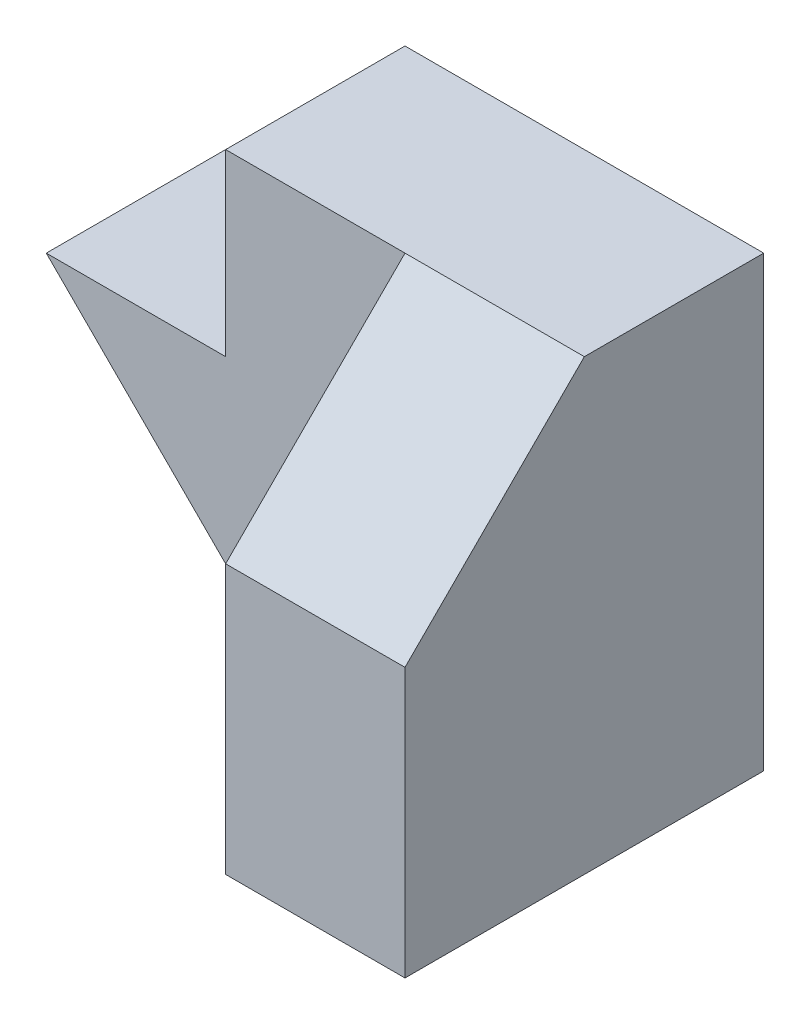
ISO-10303-21;
HEADER;
FILE_DESCRIPTION(('STEP AP214'),'2;1');
FILE_NAME('part.step','',(''),(''),'','','');
FILE_SCHEMA(('AUTOMOTIVE_DESIGN { 1 0 10303 214 1 1 1 1 }'));
ENDSEC;
DATA;
#1=APPLICATION_CONTEXT('core data for automotive mechanical design processes');
#2=APPLICATION_PROTOCOL_DEFINITION('international standard','automotive_design',2000,#1);
#3=PRODUCT_CONTEXT('',#1,'mechanical');
#4=PRODUCT('Part','Part','',(#3));
#5=PRODUCT_RELATED_PRODUCT_CATEGORY('part','',(#4));
#6=PRODUCT_DEFINITION_FORMATION('','',#4);
#7=PRODUCT_DEFINITION_CONTEXT('part definition',#1,'design');
#8=PRODUCT_DEFINITION('design','',#6,#7);
#9=PRODUCT_DEFINITION_SHAPE('','',#8);
#10=(LENGTH_UNIT() NAMED_UNIT(*) SI_UNIT(.MILLI.,.METRE.));
#11=(NAMED_UNIT(*) PLANE_ANGLE_UNIT() SI_UNIT($,.RADIAN.));
#12=(NAMED_UNIT(*) SI_UNIT($,.STERADIAN.) SOLID_ANGLE_UNIT());
#13=UNCERTAINTY_MEASURE_WITH_UNIT(LENGTH_MEASURE(1.E-05),#10,'distance_accuracy_value','');
#14=(GEOMETRIC_REPRESENTATION_CONTEXT(3) GLOBAL_UNCERTAINTY_ASSIGNED_CONTEXT((#13)) GLOBAL_UNIT_ASSIGNED_CONTEXT((#10,
#11,#12)) REPRESENTATION_CONTEXT('',''));
#15=CARTESIAN_POINT('',(0.,0.,0.));
#16=DIRECTION('',(0.,0.,1.));
#17=DIRECTION('',(1.,0.,0.));
#18=AXIS2_PLACEMENT_3D('',#15,#16,#17);
#19=CARTESIAN_POINT('',(15.,0.,20.));
#20=DIRECTION('',(-1.,0.,0.));
#21=DIRECTION('',(0.,0.,1.));
#22=AXIS2_PLACEMENT_3D('',#19,#20,#21);
#23=PLANE('',#22);
#24=DIRECTION('',(0.,0.707106781186547,-0.707106781186548));
#25=VECTOR('',#24,1.);
#26=CARTESIAN_POINT('',(15.,15.,20.));
#27=LINE('',#26,#25);
#28=CARTESIAN_POINT('',(15.,15.,20.));
#29=VERTEX_POINT('',#28);
#30=CARTESIAN_POINT('',(15.,25.,10.));
#31=VERTEX_POINT('',#30);
#32=EDGE_CURVE('E156',#29,#31,#27,.T.);
#33=ORIENTED_EDGE('',*,*,#32,.F.);
#34=DIRECTION('',(0.,1.,0.));
#35=VECTOR('',#34,1.);
#36=CARTESIAN_POINT('',(15.,0.,20.));
#37=LINE('',#36,#35);
#38=CARTESIAN_POINT('',(15.,0.,20.));
#39=VERTEX_POINT('',#38);
#40=EDGE_CURVE('E109',#39,#29,#37,.T.);
#41=ORIENTED_EDGE('',*,*,#40,.F.);
#42=DIRECTION('',(0.,0.,-1.));
#43=VECTOR('',#42,1.);
#44=CARTESIAN_POINT('',(15.,0.,20.));
#45=LINE('',#44,#43);
#46=CARTESIAN_POINT('',(15.,0.,0.));
#47=VERTEX_POINT('',#46);
#48=EDGE_CURVE('E41',#39,#47,#45,.T.);
#49=ORIENTED_EDGE('',*,*,#48,.T.);
#50=DIRECTION('',(0.,1.,0.));
#51=VECTOR('',#50,1.);
#52=CARTESIAN_POINT('',(15.,0.,0.));
#53=LINE('',#52,#51);
#54=CARTESIAN_POINT('',(15.,25.,0.));
#55=VERTEX_POINT('',#54);
#56=EDGE_CURVE('E123',#47,#55,#53,.T.);
#57=ORIENTED_EDGE('',*,*,#56,.T.);
#58=DIRECTION('',(0.,0.,-1.));
#59=VECTOR('',#58,1.);
#60=CARTESIAN_POINT('',(15.,25.,20.));
#61=LINE('',#60,#59);
#62=EDGE_CURVE('E115',#31,#55,#61,.T.);
#63=ORIENTED_EDGE('',*,*,#62,.F.);
#64=EDGE_LOOP('',(#33,#41,#49,#57,#63));
#65=FACE_BOUND('',#64,.T.);
#66=ADVANCED_FACE('F33',(#65),#23,.F.);
#67=CARTESIAN_POINT('',(15.,25.,20.));
#68=DIRECTION('',(0.,-1.,0.));
#69=DIRECTION('',(1.,0.,0.));
#70=AXIS2_PLACEMENT_3D('',#67,#68,#69);
#71=PLANE('',#70);
#72=DIRECTION('',(-1.,0.,0.));
#73=VECTOR('',#72,1.);
#74=CARTESIAN_POINT('',(15.,25.,10.));
#75=LINE('',#74,#73);
#76=CARTESIAN_POINT('',(5.,25.,10.));
#77=VERTEX_POINT('',#76);
#78=EDGE_CURVE('E153',#31,#77,#75,.T.);
#79=ORIENTED_EDGE('',*,*,#78,.F.);
#80=ORIENTED_EDGE('',*,*,#62,.T.);
#81=DIRECTION('',(-1.,0.,0.));
#82=VECTOR('',#81,1.);
#83=CARTESIAN_POINT('',(15.,25.,0.));
#84=LINE('',#83,#82);
#85=CARTESIAN_POINT('',(-5.,25.,0.));
#86=VERTEX_POINT('',#85);
#87=EDGE_CURVE('E102',#55,#86,#84,.T.);
#88=ORIENTED_EDGE('',*,*,#87,.T.);
#89=DIRECTION('',(0.,0.,-1.));
#90=VECTOR('',#89,1.);
#91=CARTESIAN_POINT('',(-5.,25.,20.));
#92=LINE('',#91,#90);
#93=CARTESIAN_POINT('',(-5.,25.,10.));
#94=VERTEX_POINT('',#93);
#95=EDGE_CURVE('E92',#94,#86,#92,.T.);
#96=ORIENTED_EDGE('',*,*,#95,.F.);
#97=DIRECTION('',(-1.,0.,0.));
#98=VECTOR('',#97,1.);
#99=CARTESIAN_POINT('',(-5.,25.,10.));
#100=LINE('',#99,#98);
#101=EDGE_CURVE('E135',#77,#94,#100,.T.);
#102=ORIENTED_EDGE('',*,*,#101,.F.);
#103=EDGE_LOOP('',(#79,#80,#88,#96,#102));
#104=FACE_BOUND('',#103,.T.);
#105=ADVANCED_FACE('F172',(#104),#71,.F.);
#106=CARTESIAN_POINT('',(0.,0.,20.));
#107=DIRECTION('',(0.,0.,1.));
#108=DIRECTION('',(1.,0.,0.));
#109=AXIS2_PLACEMENT_3D('',#106,#107,#108);
#110=PLANE('',#109);
#111=ORIENTED_EDGE('',*,*,#40,.T.);
#112=DIRECTION('',(-1.,0.,0.));
#113=VECTOR('',#112,1.);
#114=CARTESIAN_POINT('',(15.,15.,20.));
#115=LINE('',#114,#113);
#116=CARTESIAN_POINT('',(5.,15.,20.));
#117=VERTEX_POINT('',#116);
#118=EDGE_CURVE('E136',#29,#117,#115,.T.);
#119=ORIENTED_EDGE('',*,*,#118,.T.);
#120=DIRECTION('',(0.,1.,0.));
#121=VECTOR('',#120,1.);
#122=CARTESIAN_POINT('',(5.,25.,20.));
#123=LINE('',#122,#121);
#124=CARTESIAN_POINT('',(5.,0.,20.));
#125=VERTEX_POINT('',#124);
#126=EDGE_CURVE('E133',#125,#117,#123,.T.);
#127=ORIENTED_EDGE('',*,*,#126,.F.);
#128=DIRECTION('',(1.,0.,0.));
#129=VECTOR('',#128,1.);
#130=CARTESIAN_POINT('',(0.,0.,20.));
#131=LINE('',#130,#129);
#132=EDGE_CURVE('E56',#125,#39,#131,.T.);
#133=ORIENTED_EDGE('',*,*,#132,.T.);
#134=EDGE_LOOP('',(#111,#119,#127,#133));
#135=FACE_BOUND('',#134,.T.);
#136=ADVANCED_FACE('F201',(#135),#110,.T.);
#137=CARTESIAN_POINT('',(5.,25.,10.));
#138=DIRECTION('',(1.,0.,0.));
#139=DIRECTION('',(0.,1.,0.));
#140=AXIS2_PLACEMENT_3D('',#137,#138,#139);
#141=PLANE('',#140);
#142=DIRECTION('',(0.,0.707106781186547,-0.707106781186548));
#143=VECTOR('',#142,1.);
#144=CARTESIAN_POINT('',(5.,15.,20.));
#145=LINE('',#144,#143);
#146=EDGE_CURVE('E157',#117,#77,#145,.T.);
#147=ORIENTED_EDGE('',*,*,#146,.T.);
#148=DIRECTION('',(0.,1.,0.));
#149=VECTOR('',#148,1.);
#150=CARTESIAN_POINT('',(5.,25.,10.));
#151=LINE('',#150,#149);
#152=CARTESIAN_POINT('',(5.,0.,10.));
#153=VERTEX_POINT('',#152);
#154=EDGE_CURVE('E132',#153,#77,#151,.T.);
#155=ORIENTED_EDGE('',*,*,#154,.F.);
#156=DIRECTION('',(0.,0.,1.));
#157=VECTOR('',#156,1.);
#158=CARTESIAN_POINT('',(5.,0.,10.));
#159=LINE('',#158,#157);
#160=EDGE_CURVE('E48',#153,#125,#159,.T.);
#161=ORIENTED_EDGE('',*,*,#160,.T.);
#162=ORIENTED_EDGE('',*,*,#126,.T.);
#163=EDGE_LOOP('',(#147,#155,#161,#162));
#164=FACE_BOUND('',#163,.T.);
#165=ADVANCED_FACE('F187',(#164),#141,.F.);
#166=CARTESIAN_POINT('',(-15.,15.,20.));
#167=DIRECTION('',(0.707106781186547,0.707106781186548,0.));
#168=DIRECTION('',(-0.707106781186548,0.707106781186547,0.));
#169=AXIS2_PLACEMENT_3D('',#166,#167,#168);
#170=PLANE('',#169);
#171=DIRECTION('',(0.,0.,-1.));
#172=VECTOR('',#171,1.);
#173=CARTESIAN_POINT('',(0.,0.,20.));
#174=LINE('',#173,#172);
#175=CARTESIAN_POINT('',(0.,0.,10.));
#176=VERTEX_POINT('',#175);
#177=CARTESIAN_POINT('',(0.,0.,0.));
#178=VERTEX_POINT('',#177);
#179=EDGE_CURVE('E11',#176,#178,#174,.T.);
#180=ORIENTED_EDGE('',*,*,#179,.F.);
#181=DIRECTION('',(0.707106781186548,-0.707106781186547,0.));
#182=VECTOR('',#181,1.);
#183=CARTESIAN_POINT('',(0.,0.,10.));
#184=LINE('',#183,#182);
#185=CARTESIAN_POINT('',(-15.,15.,10.));
#186=VERTEX_POINT('',#185);
#187=EDGE_CURVE('E142',#186,#176,#184,.T.);
#188=ORIENTED_EDGE('',*,*,#187,.F.);
#189=DIRECTION('',(0.,0.,-1.));
#190=VECTOR('',#189,1.);
#191=CARTESIAN_POINT('',(-15.,15.,20.));
#192=LINE('',#191,#190);
#193=CARTESIAN_POINT('',(-15.,15.,0.));
#194=VERTEX_POINT('',#193);
#195=EDGE_CURVE('E93',#186,#194,#192,.T.);
#196=ORIENTED_EDGE('',*,*,#195,.T.);
#197=DIRECTION('',(0.707106781186548,-0.707106781186547,0.));
#198=VECTOR('',#197,1.);
#199=CARTESIAN_POINT('',(-15.,15.,0.));
#200=LINE('',#199,#198);
#201=EDGE_CURVE('E107',#194,#178,#200,.T.);
#202=ORIENTED_EDGE('',*,*,#201,.T.);
#203=EDGE_LOOP('',(#180,#188,#196,#202));
#204=FACE_BOUND('',#203,.T.);
#205=ADVANCED_FACE('F35',(#204),#170,.F.);
#206=CARTESIAN_POINT('',(0.,0.,20.));
#207=DIRECTION('',(0.,1.,0.));
#208=DIRECTION('',(0.,0.,1.));
#209=AXIS2_PLACEMENT_3D('',#206,#207,#208);
#210=PLANE('',#209);
#211=ORIENTED_EDGE('',*,*,#132,.F.);
#212=ORIENTED_EDGE('',*,*,#160,.F.);
#213=DIRECTION('',(1.,0.,0.));
#214=VECTOR('',#213,1.);
#215=CARTESIAN_POINT('',(5.,0.,10.));
#216=LINE('',#215,#214);
#217=EDGE_CURVE('E139',#176,#153,#216,.T.);
#218=ORIENTED_EDGE('',*,*,#217,.F.);
#219=ORIENTED_EDGE('',*,*,#179,.T.);
#220=DIRECTION('',(1.,0.,0.));
#221=VECTOR('',#220,1.);
#222=CARTESIAN_POINT('',(0.,0.,0.));
#223=LINE('',#222,#221);
#224=EDGE_CURVE('E125',#178,#47,#223,.T.);
#225=ORIENTED_EDGE('',*,*,#224,.T.);
#226=ORIENTED_EDGE('',*,*,#48,.F.);
#227=EDGE_LOOP('',(#211,#212,#218,#219,#225,#226));
#228=FACE_BOUND('',#227,.T.);
#229=ADVANCED_FACE('F188',(#228),#210,.F.);
#230=CARTESIAN_POINT('',(-5.,25.,20.));
#231=DIRECTION('',(1.,0.,0.));
#232=DIRECTION('',(0.,0.,-1.));
#233=AXIS2_PLACEMENT_3D('',#230,#231,#232);
#234=PLANE('',#233);
#235=DIRECTION('',(0.,0.,-1.));
#236=VECTOR('',#235,1.);
#237=CARTESIAN_POINT('',(-5.,15.,20.));
#238=LINE('',#237,#236);
#239=CARTESIAN_POINT('',(-5.,15.,10.));
#240=VERTEX_POINT('',#239);
#241=CARTESIAN_POINT('',(-5.,15.,0.));
#242=VERTEX_POINT('',#241);
#243=EDGE_CURVE('E80',#240,#242,#238,.T.);
#244=ORIENTED_EDGE('',*,*,#243,.F.);
#245=DIRECTION('',(0.,-1.,0.));
#246=VECTOR('',#245,1.);
#247=CARTESIAN_POINT('',(-5.,15.,10.));
#248=LINE('',#247,#246);
#249=EDGE_CURVE('E146',#94,#240,#248,.T.);
#250=ORIENTED_EDGE('',*,*,#249,.F.);
#251=ORIENTED_EDGE('',*,*,#95,.T.);
#252=DIRECTION('',(0.,-1.,0.));
#253=VECTOR('',#252,1.);
#254=CARTESIAN_POINT('',(-5.,25.,0.));
#255=LINE('',#254,#253);
#256=EDGE_CURVE('E96',#86,#242,#255,.T.);
#257=ORIENTED_EDGE('',*,*,#256,.T.);
#258=EDGE_LOOP('',(#244,#250,#251,#257));
#259=FACE_BOUND('',#258,.T.);
#260=ADVANCED_FACE('F97',(#259),#234,.F.);
#261=CARTESIAN_POINT('',(-5.,15.,20.));
#262=DIRECTION('',(0.,-1.,0.));
#263=DIRECTION('',(1.,0.,0.));
#264=AXIS2_PLACEMENT_3D('',#261,#262,#263);
#265=PLANE('',#264);
#266=ORIENTED_EDGE('',*,*,#195,.F.);
#267=DIRECTION('',(-1.,0.,0.));
#268=VECTOR('',#267,1.);
#269=CARTESIAN_POINT('',(-15.,15.,10.));
#270=LINE('',#269,#268);
#271=EDGE_CURVE('E89',#240,#186,#270,.T.);
#272=ORIENTED_EDGE('',*,*,#271,.F.);
#273=ORIENTED_EDGE('',*,*,#243,.T.);
#274=DIRECTION('',(-1.,0.,0.));
#275=VECTOR('',#274,1.);
#276=CARTESIAN_POINT('',(-5.,15.,0.));
#277=LINE('',#276,#275);
#278=EDGE_CURVE('E85',#242,#194,#277,.T.);
#279=ORIENTED_EDGE('',*,*,#278,.T.);
#280=EDGE_LOOP('',(#266,#272,#273,#279));
#281=FACE_BOUND('',#280,.T.);
#282=ADVANCED_FACE('F83',(#281),#265,.F.);
#283=CARTESIAN_POINT('',(0.,0.,0.));
#284=DIRECTION('',(0.,0.,1.));
#285=DIRECTION('',(1.,0.,0.));
#286=AXIS2_PLACEMENT_3D('',#283,#284,#285);
#287=PLANE('',#286);
#288=ORIENTED_EDGE('',*,*,#201,.F.);
#289=ORIENTED_EDGE('',*,*,#278,.F.);
#290=ORIENTED_EDGE('',*,*,#256,.F.);
#291=ORIENTED_EDGE('',*,*,#87,.F.);
#292=ORIENTED_EDGE('',*,*,#56,.F.);
#293=ORIENTED_EDGE('',*,*,#224,.F.);
#294=EDGE_LOOP('',(#288,#289,#290,#291,#292,#293));
#295=FACE_BOUND('',#294,.T.);
#296=ADVANCED_FACE('F104',(#295),#287,.F.);
#297=CARTESIAN_POINT('',(0.,0.,10.));
#298=DIRECTION('',(0.,0.,-1.));
#299=DIRECTION('',(-1.,0.,0.));
#300=AXIS2_PLACEMENT_3D('',#297,#298,#299);
#301=PLANE('',#300);
#302=ORIENTED_EDGE('',*,*,#101,.T.);
#303=ORIENTED_EDGE('',*,*,#249,.T.);
#304=ORIENTED_EDGE('',*,*,#271,.T.);
#305=ORIENTED_EDGE('',*,*,#187,.T.);
#306=ORIENTED_EDGE('',*,*,#217,.T.);
#307=ORIENTED_EDGE('',*,*,#154,.T.);
#308=EDGE_LOOP('',(#302,#303,#304,#305,#306,#307));
#309=FACE_BOUND('',#308,.T.);
#310=ADVANCED_FACE('F175',(#309),#301,.F.);
#311=CARTESIAN_POINT('',(15.,15.,20.));
#312=DIRECTION('',(0.,0.707106781186548,0.707106781186547));
#313=DIRECTION('',(0.,-0.707106781186547,0.707106781186548));
#314=AXIS2_PLACEMENT_3D('',#311,#312,#313);
#315=PLANE('',#314);
#316=ORIENTED_EDGE('',*,*,#146,.F.);
#317=ORIENTED_EDGE('',*,*,#118,.F.);
#318=ORIENTED_EDGE('',*,*,#32,.T.);
#319=ORIENTED_EDGE('',*,*,#78,.T.);
#320=EDGE_LOOP('',(#316,#317,#318,#319));
#321=FACE_BOUND('',#320,.T.);
#322=ADVANCED_FACE('F166',(#321),#315,.T.);
#323=CLOSED_SHELL('',(#66,#105,#136,#165,#205,#229,#260,#282,#296,#310,#322));
#324=MANIFOLD_SOLID_BREP('B2',#323);
#325=ADVANCED_BREP_SHAPE_REPRESENTATION('',(#18,#324),#14);
#326=SHAPE_DEFINITION_REPRESENTATION(#9,#325);
ENDSEC;
END-ISO-10303-21;
